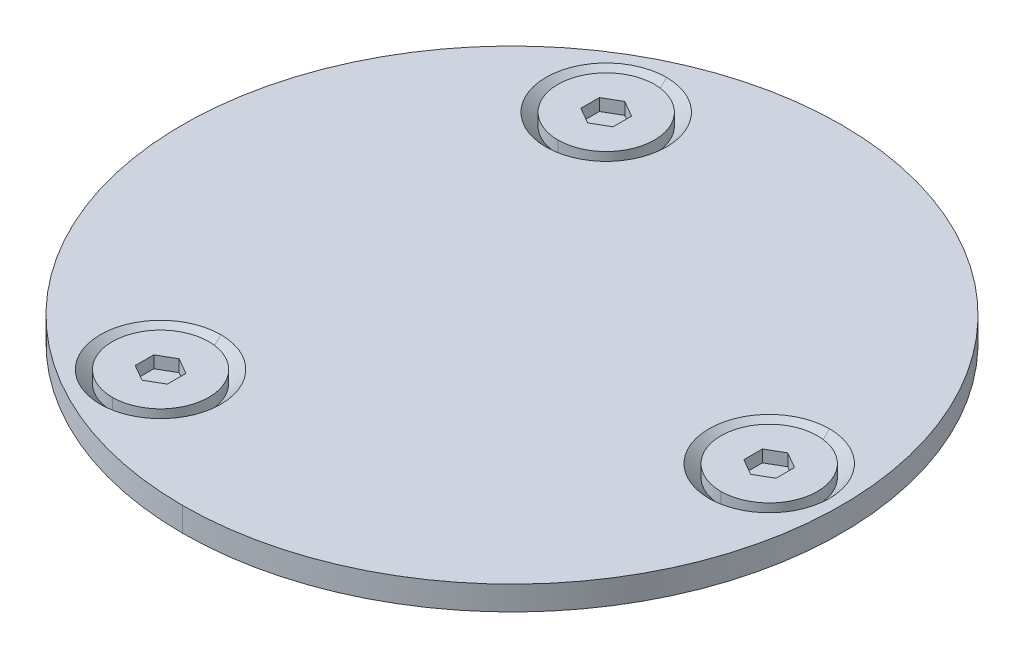
ISO-10303-21;
HEADER;
FILE_DESCRIPTION(('STEP AP214'),'2;1');
FILE_NAME('part.step','',(''),(''),'','','');
FILE_SCHEMA(('AUTOMOTIVE_DESIGN { 1 0 10303 214 1 1 1 1 }'));
ENDSEC;
DATA;
#1=APPLICATION_CONTEXT('core data for automotive mechanical design processes');
#2=APPLICATION_PROTOCOL_DEFINITION('international standard','automotive_design',2000,#1);
#3=PRODUCT_CONTEXT('',#1,'mechanical');
#4=PRODUCT('Part','Part','',(#3));
#5=PRODUCT_RELATED_PRODUCT_CATEGORY('part','',(#4));
#6=PRODUCT_DEFINITION_FORMATION('','',#4);
#7=PRODUCT_DEFINITION_CONTEXT('part definition',#1,'design');
#8=PRODUCT_DEFINITION('design','',#6,#7);
#9=PRODUCT_DEFINITION_SHAPE('','',#8);
#10=(LENGTH_UNIT() NAMED_UNIT(*) SI_UNIT(.MILLI.,.METRE.));
#11=(NAMED_UNIT(*) PLANE_ANGLE_UNIT() SI_UNIT($,.RADIAN.));
#12=(NAMED_UNIT(*) SI_UNIT($,.STERADIAN.) SOLID_ANGLE_UNIT());
#13=UNCERTAINTY_MEASURE_WITH_UNIT(LENGTH_MEASURE(1.E-05),#10,'distance_accuracy_value','');
#14=(GEOMETRIC_REPRESENTATION_CONTEXT(3) GLOBAL_UNCERTAINTY_ASSIGNED_CONTEXT((#13)) GLOBAL_UNIT_ASSIGNED_CONTEXT((#10,
#11,#12)) REPRESENTATION_CONTEXT('',''));
#15=CARTESIAN_POINT('',(0.,0.,0.));
#16=DIRECTION('',(0.,0.,1.));
#17=DIRECTION('',(1.,0.,0.));
#18=AXIS2_PLACEMENT_3D('',#15,#16,#17);
#19=CARTESIAN_POINT('',(0.,1.5,0.));
#20=DIRECTION('',(0.,-1.,0.));
#21=DIRECTION('',(1.,0.,0.));
#22=AXIS2_PLACEMENT_3D('',#19,#20,#21);
#23=CYLINDRICAL_SURFACE('',#22,20.5);
#24=DIRECTION('',(0.,-1.,0.));
#25=VECTOR('',#24,1.);
#26=CARTESIAN_POINT('',(0.,1.5,20.5));
#27=LINE('',#26,#25);
#28=CARTESIAN_POINT('',(0.,1.5,20.5));
#29=VERTEX_POINT('',#28);
#30=CARTESIAN_POINT('',(0.,0.,20.5));
#31=VERTEX_POINT('',#30);
#32=EDGE_CURVE('E11',#29,#31,#27,.T.);
#33=ORIENTED_EDGE('',*,*,#32,.F.);
#34=CARTESIAN_POINT('',(0.,1.5,0.));
#35=DIRECTION('',(0.,1.,0.));
#36=DIRECTION('',(1.,0.,0.));
#37=AXIS2_PLACEMENT_3D('',#34,#35,#36);
#38=CIRCLE('',#37,20.5);
#39=CARTESIAN_POINT('',(0.,1.5,-20.5));
#40=VERTEX_POINT('',#39);
#41=EDGE_CURVE('E25',#40,#29,#38,.T.);
#42=ORIENTED_EDGE('',*,*,#41,.F.);
#43=DIRECTION('',(0.,-1.,0.));
#44=VECTOR('',#43,1.);
#45=CARTESIAN_POINT('',(0.,1.5,-20.5));
#46=LINE('',#45,#44);
#47=CARTESIAN_POINT('',(0.,0.,-20.5));
#48=VERTEX_POINT('',#47);
#49=EDGE_CURVE('E631',#40,#48,#46,.T.);
#50=ORIENTED_EDGE('',*,*,#49,.T.);
#51=CARTESIAN_POINT('',(0.,0.,0.));
#52=DIRECTION('',(0.,1.,0.));
#53=DIRECTION('',(1.,0.,0.));
#54=AXIS2_PLACEMENT_3D('',#51,#52,#53);
#55=CIRCLE('',#54,20.5);
#56=EDGE_CURVE('E627',#48,#31,#55,.T.);
#57=ORIENTED_EDGE('',*,*,#56,.T.);
#58=EDGE_LOOP('',(#33,#42,#50,#57));
#59=FACE_BOUND('',#58,.T.);
#60=ADVANCED_FACE('F17',(#59),#23,.T.);
#61=CARTESIAN_POINT('',(0.,0.,0.));
#62=DIRECTION('',(0.,1.,0.));
#63=DIRECTION('',(0.,0.,1.));
#64=AXIS2_PLACEMENT_3D('',#61,#62,#63);
#65=PLANE('',#64);
#66=CARTESIAN_POINT('',(0.,0.,0.));
#67=DIRECTION('',(0.,1.,0.));
#68=DIRECTION('',(0.,0.,1.));
#69=AXIS2_PLACEMENT_3D('',#66,#67,#68);
#70=CIRCLE('',#69,20.5);
#71=EDGE_CURVE('E622',#31,#48,#70,.T.);
#72=ORIENTED_EDGE('',*,*,#71,.F.);
#73=ORIENTED_EDGE('',*,*,#56,.F.);
#74=EDGE_LOOP('',(#72,#73));
#75=FACE_BOUND('',#74,.T.);
#76=ADVANCED_FACE('F646',(#75),#65,.F.);
#77=CARTESIAN_POINT('',(0.,1.5,0.));
#78=DIRECTION('',(0.,-1.,0.));
#79=DIRECTION('',(-1.,0.,0.));
#80=AXIS2_PLACEMENT_3D('',#77,#78,#79);
#81=CYLINDRICAL_SURFACE('',#80,20.5);
#82=ORIENTED_EDGE('',*,*,#32,.T.);
#83=ORIENTED_EDGE('',*,*,#71,.T.);
#84=ORIENTED_EDGE('',*,*,#49,.F.);
#85=CARTESIAN_POINT('',(0.,1.5,0.));
#86=DIRECTION('',(0.,1.,0.));
#87=DIRECTION('',(0.,0.,1.));
#88=AXIS2_PLACEMENT_3D('',#85,#86,#87);
#89=CIRCLE('',#88,20.5);
#90=EDGE_CURVE('E617',#29,#40,#89,.T.);
#91=ORIENTED_EDGE('',*,*,#90,.F.);
#92=EDGE_LOOP('',(#82,#83,#84,#91));
#93=FACE_BOUND('',#92,.T.);
#94=ADVANCED_FACE('F642',(#93),#81,.T.);
#95=CARTESIAN_POINT('',(0.,1.5,0.));
#96=DIRECTION('',(0.,1.,0.));
#97=DIRECTION('',(0.,0.,1.));
#98=AXIS2_PLACEMENT_3D('',#95,#96,#97);
#99=PLANE('',#98);
#100=CARTESIAN_POINT('',(-8.,1.5,13.86));
#101=DIRECTION('',(0.,-1.,0.));
#102=DIRECTION('',(0.,0.,-1.));
#103=AXIS2_PLACEMENT_3D('',#100,#101,#102);
#104=CIRCLE('',#103,3.75);
#105=CARTESIAN_POINT('',(-8.,1.5,10.11));
#106=VERTEX_POINT('',#105);
#107=CARTESIAN_POINT('',(-8.,1.5,17.61));
#108=VERTEX_POINT('',#107);
#109=EDGE_CURVE('E613',#106,#108,#104,.T.);
#110=ORIENTED_EDGE('',*,*,#109,.T.);
#111=CARTESIAN_POINT('',(-8.,1.5,13.86));
#112=DIRECTION('',(0.,-1.,0.));
#113=DIRECTION('',(0.,0.,-1.));
#114=AXIS2_PLACEMENT_3D('',#111,#112,#113);
#115=CIRCLE('',#114,3.75);
#116=EDGE_CURVE('E609',#108,#106,#115,.T.);
#117=ORIENTED_EDGE('',*,*,#116,.T.);
#118=EDGE_LOOP('',(#110,#117));
#119=FACE_BOUND('',#118,.T.);
#120=CARTESIAN_POINT('',(-8.,1.5,-13.86));
#121=DIRECTION('',(0.,-1.,0.));
#122=DIRECTION('',(0.,0.,-1.));
#123=AXIS2_PLACEMENT_3D('',#120,#121,#122);
#124=CIRCLE('',#123,3.75);
#125=CARTESIAN_POINT('',(-8.,1.5,-17.61));
#126=VERTEX_POINT('',#125);
#127=CARTESIAN_POINT('',(-8.,1.5,-10.11));
#128=VERTEX_POINT('',#127);
#129=EDGE_CURVE('E605',#126,#128,#124,.T.);
#130=ORIENTED_EDGE('',*,*,#129,.T.);
#131=CARTESIAN_POINT('',(-8.,1.5,-13.86));
#132=DIRECTION('',(0.,-1.,0.));
#133=DIRECTION('',(0.,0.,-1.));
#134=AXIS2_PLACEMENT_3D('',#131,#132,#133);
#135=CIRCLE('',#134,3.75);
#136=EDGE_CURVE('E601',#128,#126,#135,.T.);
#137=ORIENTED_EDGE('',*,*,#136,.T.);
#138=EDGE_LOOP('',(#130,#137));
#139=FACE_BOUND('',#138,.T.);
#140=CARTESIAN_POINT('',(16.,1.5,0.));
#141=DIRECTION('',(0.,-1.,0.));
#142=DIRECTION('',(0.,0.,-1.));
#143=AXIS2_PLACEMENT_3D('',#140,#141,#142);
#144=CIRCLE('',#143,3.75);
#145=CARTESIAN_POINT('',(16.,1.5,-3.75));
#146=VERTEX_POINT('',#145);
#147=CARTESIAN_POINT('',(16.,1.5,3.75));
#148=VERTEX_POINT('',#147);
#149=EDGE_CURVE('E597',#146,#148,#144,.T.);
#150=ORIENTED_EDGE('',*,*,#149,.T.);
#151=CARTESIAN_POINT('',(16.,1.5,0.));
#152=DIRECTION('',(0.,-1.,0.));
#153=DIRECTION('',(0.,0.,-1.));
#154=AXIS2_PLACEMENT_3D('',#151,#152,#153);
#155=CIRCLE('',#154,3.75);
#156=EDGE_CURVE('E593',#148,#146,#155,.T.);
#157=ORIENTED_EDGE('',*,*,#156,.T.);
#158=EDGE_LOOP('',(#150,#157));
#159=FACE_BOUND('',#158,.T.);
#160=ORIENTED_EDGE('',*,*,#90,.T.);
#161=ORIENTED_EDGE('',*,*,#41,.T.);
#162=EDGE_LOOP('',(#160,#161));
#163=FACE_BOUND('',#162,.T.);
#164=ADVANCED_FACE('F640',(#119,#139,#159,#163),#99,.T.);
#165=CARTESIAN_POINT('',(16.,0.75000000000003,0.));
#166=DIRECTION('',(0.,1.,0.));
#167=DIRECTION('',(1.,0.,0.));
#168=AXIS2_PLACEMENT_3D('',#165,#166,#167);
#169=CONICAL_SURFACE('',#168,3.,0.785398163397469);
#170=DIRECTION('',(0.,0.707106781186533,-0.707106781186562));
#171=VECTOR('',#170,1.);
#172=CARTESIAN_POINT('',(16.,0.75000000000003,-3.));
#173=LINE('',#172,#171);
#174=CARTESIAN_POINT('',(16.,0.75000000000003,-3.));
#175=VERTEX_POINT('',#174);
#176=EDGE_CURVE('E588',#175,#146,#173,.T.);
#177=ORIENTED_EDGE('',*,*,#176,.T.);
#178=ORIENTED_EDGE('',*,*,#156,.F.);
#179=DIRECTION('',(0.,0.707106781186533,0.707106781186562));
#180=VECTOR('',#179,1.);
#181=CARTESIAN_POINT('',(16.,0.75000000000003,3.));
#182=LINE('',#181,#180);
#183=CARTESIAN_POINT('',(16.,0.75000000000003,3.));
#184=VERTEX_POINT('',#183);
#185=EDGE_CURVE('E583',#184,#148,#182,.T.);
#186=ORIENTED_EDGE('',*,*,#185,.F.);
#187=CARTESIAN_POINT('',(16.,0.75000000000003,0.));
#188=DIRECTION('',(0.,-1.,0.));
#189=DIRECTION('',(0.,0.,-1.));
#190=AXIS2_PLACEMENT_3D('',#187,#188,#189);
#191=CIRCLE('',#190,3.);
#192=EDGE_CURVE('E579',#184,#175,#191,.T.);
#193=ORIENTED_EDGE('',*,*,#192,.T.);
#194=EDGE_LOOP('',(#177,#178,#186,#193));
#195=FACE_BOUND('',#194,.T.);
#196=ADVANCED_FACE('F657',(#195),#169,.F.);
#197=CARTESIAN_POINT('',(16.,0.,0.));
#198=DIRECTION('',(0.,-1.,0.));
#199=DIRECTION('',(1.,0.,-1.61702901641324E-09));
#200=AXIS2_PLACEMENT_3D('',#197,#198,#199);
#201=CYLINDRICAL_SURFACE('',#200,3.);
#202=DIRECTION('',(0.,-1.,0.));
#203=VECTOR('',#202,1.);
#204=CARTESIAN_POINT('',(16.,1.5,3.));
#205=LINE('',#204,#203);
#206=CARTESIAN_POINT('',(16.,1.5,3.));
#207=VERTEX_POINT('',#206);
#208=EDGE_CURVE('E574',#207,#184,#205,.T.);
#209=ORIENTED_EDGE('',*,*,#208,.F.);
#210=CARTESIAN_POINT('',(16.,1.5,0.));
#211=DIRECTION('',(0.,-1.,0.));
#212=DIRECTION('',(0.,0.,-1.));
#213=AXIS2_PLACEMENT_3D('',#210,#211,#212);
#214=CIRCLE('',#213,3.);
#215=CARTESIAN_POINT('',(16.,1.5,-3.));
#216=VERTEX_POINT('',#215);
#217=EDGE_CURVE('E570',#207,#216,#214,.T.);
#218=ORIENTED_EDGE('',*,*,#217,.T.);
#219=DIRECTION('',(0.,-1.,0.));
#220=VECTOR('',#219,1.);
#221=CARTESIAN_POINT('',(16.,1.5,-3.));
#222=LINE('',#221,#220);
#223=EDGE_CURVE('E565',#216,#175,#222,.T.);
#224=ORIENTED_EDGE('',*,*,#223,.T.);
#225=ORIENTED_EDGE('',*,*,#192,.F.);
#226=EDGE_LOOP('',(#209,#218,#224,#225));
#227=FACE_BOUND('',#226,.T.);
#228=ADVANCED_FACE('F661',(#227),#201,.T.);
#229=CARTESIAN_POINT('',(16.,0.,0.));
#230=DIRECTION('',(0.,-1.,0.));
#231=DIRECTION('',(-1.,0.,0.));
#232=AXIS2_PLACEMENT_3D('',#229,#230,#231);
#233=CYLINDRICAL_SURFACE('',#232,3.);
#234=ORIENTED_EDGE('',*,*,#208,.T.);
#235=CARTESIAN_POINT('',(16.,0.75000000000003,0.));
#236=DIRECTION('',(0.,-1.,0.));
#237=DIRECTION('',(0.,0.,-1.));
#238=AXIS2_PLACEMENT_3D('',#235,#236,#237);
#239=CIRCLE('',#238,3.);
#240=EDGE_CURVE('E560',#175,#184,#239,.T.);
#241=ORIENTED_EDGE('',*,*,#240,.F.);
#242=ORIENTED_EDGE('',*,*,#223,.F.);
#243=CARTESIAN_POINT('',(16.,1.5,0.));
#244=DIRECTION('',(0.,-1.,0.));
#245=DIRECTION('',(0.,0.,-1.));
#246=AXIS2_PLACEMENT_3D('',#243,#244,#245);
#247=CIRCLE('',#246,3.);
#248=EDGE_CURVE('E555',#216,#207,#247,.T.);
#249=ORIENTED_EDGE('',*,*,#248,.T.);
#250=EDGE_LOOP('',(#234,#241,#242,#249));
#251=FACE_BOUND('',#250,.T.);
#252=ADVANCED_FACE('F665',(#251),#233,.T.);
#253=CARTESIAN_POINT('',(0.,1.5,0.));
#254=DIRECTION('',(0.,1.,0.));
#255=DIRECTION('',(0.,0.,1.));
#256=AXIS2_PLACEMENT_3D('',#253,#254,#255);
#257=PLANE('',#256);
#258=DIRECTION('',(0.,0.,1.));
#259=VECTOR('',#258,1.);
#260=CARTESIAN_POINT('',(15.,1.5,-0.57735026918963));
#261=LINE('',#260,#259);
#262=CARTESIAN_POINT('',(15.,1.5,-0.57735026918963));
#263=VERTEX_POINT('',#262);
#264=CARTESIAN_POINT('',(15.,1.5,0.57735026918963));
#265=VERTEX_POINT('',#264);
#266=EDGE_CURVE('E550',#263,#265,#261,.T.);
#267=ORIENTED_EDGE('',*,*,#266,.F.);
#268=DIRECTION('',(-0.866025403784422,0.,0.500000000000029));
#269=VECTOR('',#268,1.);
#270=CARTESIAN_POINT('',(16.,1.5,-1.1547005383793));
#271=LINE('',#270,#269);
#272=CARTESIAN_POINT('',(16.,1.5,-1.1547005383793));
#273=VERTEX_POINT('',#272);
#274=EDGE_CURVE('E545',#273,#263,#271,.T.);
#275=ORIENTED_EDGE('',*,*,#274,.F.);
#276=DIRECTION('',(-0.866025403784422,0.,-0.500000000000029));
#277=VECTOR('',#276,1.);
#278=CARTESIAN_POINT('',(17.,1.5,-0.57735026918963));
#279=LINE('',#278,#277);
#280=CARTESIAN_POINT('',(17.,1.5,-0.57735026918963));
#281=VERTEX_POINT('',#280);
#282=EDGE_CURVE('E540',#281,#273,#279,.T.);
#283=ORIENTED_EDGE('',*,*,#282,.F.);
#284=DIRECTION('',(0.,0.,-1.));
#285=VECTOR('',#284,1.);
#286=CARTESIAN_POINT('',(17.,1.5,0.57735026918963));
#287=LINE('',#286,#285);
#288=CARTESIAN_POINT('',(17.,1.5,0.57735026918963));
#289=VERTEX_POINT('',#288);
#290=EDGE_CURVE('E535',#289,#281,#287,.T.);
#291=ORIENTED_EDGE('',*,*,#290,.F.);
#292=DIRECTION('',(0.866025403784422,0.,-0.500000000000029));
#293=VECTOR('',#292,1.);
#294=CARTESIAN_POINT('',(16.,1.5,1.1547005383793));
#295=LINE('',#294,#293);
#296=CARTESIAN_POINT('',(16.,1.5,1.1547005383793));
#297=VERTEX_POINT('',#296);
#298=EDGE_CURVE('E530',#297,#289,#295,.T.);
#299=ORIENTED_EDGE('',*,*,#298,.F.);
#300=DIRECTION('',(0.866025403784422,0.,0.500000000000029));
#301=VECTOR('',#300,1.);
#302=CARTESIAN_POINT('',(15.,1.5,0.57735026918963));
#303=LINE('',#302,#301);
#304=EDGE_CURVE('E525',#265,#297,#303,.T.);
#305=ORIENTED_EDGE('',*,*,#304,.F.);
#306=EDGE_LOOP('',(#267,#275,#283,#291,#299,#305));
#307=FACE_BOUND('',#306,.T.);
#308=ORIENTED_EDGE('',*,*,#217,.F.);
#309=ORIENTED_EDGE('',*,*,#248,.F.);
#310=EDGE_LOOP('',(#308,#309));
#311=FACE_BOUND('',#310,.T.);
#312=ADVANCED_FACE('F669',(#307,#311),#257,.T.);
#313=CARTESIAN_POINT('',(15.,0.75,0.57735026918963));
#314=DIRECTION('',(-0.500000000000029,0.,0.866025403784422));
#315=DIRECTION('',(0.866025403784422,0.,0.500000000000029));
#316=AXIS2_PLACEMENT_3D('',#313,#314,#315);
#317=PLANE('',#316);
#318=ORIENTED_EDGE('',*,*,#304,.T.);
#319=DIRECTION('',(0.,1.,0.));
#320=VECTOR('',#319,1.);
#321=CARTESIAN_POINT('',(16.,0.75,1.1547005383793));
#322=LINE('',#321,#320);
#323=CARTESIAN_POINT('',(16.,0.75,1.1547005383793));
#324=VERTEX_POINT('',#323);
#325=EDGE_CURVE('E520',#324,#297,#322,.T.);
#326=ORIENTED_EDGE('',*,*,#325,.F.);
#327=DIRECTION('',(0.866025403784422,0.,0.500000000000029));
#328=VECTOR('',#327,1.);
#329=CARTESIAN_POINT('',(15.,0.75,0.57735026918963));
#330=LINE('',#329,#328);
#331=CARTESIAN_POINT('',(15.,0.75,0.57735026918963));
#332=VERTEX_POINT('',#331);
#333=EDGE_CURVE('E515',#332,#324,#330,.T.);
#334=ORIENTED_EDGE('',*,*,#333,.F.);
#335=DIRECTION('',(0.,1.,0.));
#336=VECTOR('',#335,1.);
#337=CARTESIAN_POINT('',(15.,0.75,0.57735026918963));
#338=LINE('',#337,#336);
#339=EDGE_CURVE('E510',#332,#265,#338,.T.);
#340=ORIENTED_EDGE('',*,*,#339,.T.);
#341=EDGE_LOOP('',(#318,#326,#334,#340));
#342=FACE_BOUND('',#341,.T.);
#343=ADVANCED_FACE('F673',(#342),#317,.F.);
#344=CARTESIAN_POINT('',(15.,0.75,-0.57735026918963));
#345=DIRECTION('',(-1.,0.,0.));
#346=DIRECTION('',(0.,0.,1.));
#347=AXIS2_PLACEMENT_3D('',#344,#345,#346);
#348=PLANE('',#347);
#349=ORIENTED_EDGE('',*,*,#266,.T.);
#350=ORIENTED_EDGE('',*,*,#339,.F.);
#351=DIRECTION('',(0.,0.,1.));
#352=VECTOR('',#351,1.);
#353=CARTESIAN_POINT('',(15.,0.75,-0.57735026918963));
#354=LINE('',#353,#352);
#355=CARTESIAN_POINT('',(15.,0.75,-0.57735026918963));
#356=VERTEX_POINT('',#355);
#357=EDGE_CURVE('E505',#356,#332,#354,.T.);
#358=ORIENTED_EDGE('',*,*,#357,.F.);
#359=DIRECTION('',(0.,1.,0.));
#360=VECTOR('',#359,1.);
#361=CARTESIAN_POINT('',(15.,0.75,-0.57735026918963));
#362=LINE('',#361,#360);
#363=EDGE_CURVE('E500',#356,#263,#362,.T.);
#364=ORIENTED_EDGE('',*,*,#363,.T.);
#365=EDGE_LOOP('',(#349,#350,#358,#364));
#366=FACE_BOUND('',#365,.T.);
#367=ADVANCED_FACE('F677',(#366),#348,.F.);
#368=CARTESIAN_POINT('',(16.,0.75,-1.1547005383793));
#369=DIRECTION('',(-0.500000000000029,0.,-0.866025403784422));
#370=DIRECTION('',(-0.866025403784422,0.,0.500000000000029));
#371=AXIS2_PLACEMENT_3D('',#368,#369,#370);
#372=PLANE('',#371);
#373=ORIENTED_EDGE('',*,*,#274,.T.);
#374=ORIENTED_EDGE('',*,*,#363,.F.);
#375=DIRECTION('',(-0.866025403784422,0.,0.500000000000029));
#376=VECTOR('',#375,1.);
#377=CARTESIAN_POINT('',(16.,0.75,-1.1547005383793));
#378=LINE('',#377,#376);
#379=CARTESIAN_POINT('',(16.,0.75,-1.1547005383793));
#380=VERTEX_POINT('',#379);
#381=EDGE_CURVE('E495',#380,#356,#378,.T.);
#382=ORIENTED_EDGE('',*,*,#381,.F.);
#383=DIRECTION('',(0.,1.,0.));
#384=VECTOR('',#383,1.);
#385=CARTESIAN_POINT('',(16.,0.75,-1.1547005383793));
#386=LINE('',#385,#384);
#387=EDGE_CURVE('E490',#380,#273,#386,.T.);
#388=ORIENTED_EDGE('',*,*,#387,.T.);
#389=EDGE_LOOP('',(#373,#374,#382,#388));
#390=FACE_BOUND('',#389,.T.);
#391=ADVANCED_FACE('F681',(#390),#372,.F.);
#392=CARTESIAN_POINT('',(17.,0.75,-0.57735026918963));
#393=DIRECTION('',(0.500000000000029,0.,-0.866025403784422));
#394=DIRECTION('',(-0.866025403784422,0.,-0.500000000000029));
#395=AXIS2_PLACEMENT_3D('',#392,#393,#394);
#396=PLANE('',#395);
#397=ORIENTED_EDGE('',*,*,#282,.T.);
#398=ORIENTED_EDGE('',*,*,#387,.F.);
#399=DIRECTION('',(-0.866025403784422,0.,-0.500000000000029));
#400=VECTOR('',#399,1.);
#401=CARTESIAN_POINT('',(17.,0.75,-0.57735026918963));
#402=LINE('',#401,#400);
#403=CARTESIAN_POINT('',(17.,0.75,-0.57735026918963));
#404=VERTEX_POINT('',#403);
#405=EDGE_CURVE('E485',#404,#380,#402,.T.);
#406=ORIENTED_EDGE('',*,*,#405,.F.);
#407=DIRECTION('',(0.,1.,0.));
#408=VECTOR('',#407,1.);
#409=CARTESIAN_POINT('',(17.,0.75,-0.57735026918963));
#410=LINE('',#409,#408);
#411=EDGE_CURVE('E480',#404,#281,#410,.T.);
#412=ORIENTED_EDGE('',*,*,#411,.T.);
#413=EDGE_LOOP('',(#397,#398,#406,#412));
#414=FACE_BOUND('',#413,.T.);
#415=ADVANCED_FACE('F685',(#414),#396,.F.);
#416=CARTESIAN_POINT('',(17.,0.75,0.57735026918963));
#417=DIRECTION('',(1.,0.,0.));
#418=DIRECTION('',(0.,0.,-1.));
#419=AXIS2_PLACEMENT_3D('',#416,#417,#418);
#420=PLANE('',#419);
#421=ORIENTED_EDGE('',*,*,#290,.T.);
#422=ORIENTED_EDGE('',*,*,#411,.F.);
#423=DIRECTION('',(0.,0.,-1.));
#424=VECTOR('',#423,1.);
#425=CARTESIAN_POINT('',(17.,0.75,0.57735026918963));
#426=LINE('',#425,#424);
#427=CARTESIAN_POINT('',(17.,0.75,0.57735026918963));
#428=VERTEX_POINT('',#427);
#429=EDGE_CURVE('E475',#428,#404,#426,.T.);
#430=ORIENTED_EDGE('',*,*,#429,.F.);
#431=DIRECTION('',(0.,1.,0.));
#432=VECTOR('',#431,1.);
#433=CARTESIAN_POINT('',(17.,0.75,0.57735026918963));
#434=LINE('',#433,#432);
#435=EDGE_CURVE('E470',#428,#289,#434,.T.);
#436=ORIENTED_EDGE('',*,*,#435,.T.);
#437=EDGE_LOOP('',(#421,#422,#430,#436));
#438=FACE_BOUND('',#437,.T.);
#439=ADVANCED_FACE('F689',(#438),#420,.F.);
#440=CARTESIAN_POINT('',(16.,0.75,1.1547005383793));
#441=DIRECTION('',(0.500000000000029,0.,0.866025403784422));
#442=DIRECTION('',(0.866025403784422,0.,-0.500000000000029));
#443=AXIS2_PLACEMENT_3D('',#440,#441,#442);
#444=PLANE('',#443);
#445=ORIENTED_EDGE('',*,*,#298,.T.);
#446=ORIENTED_EDGE('',*,*,#435,.F.);
#447=DIRECTION('',(0.866025403784422,0.,-0.500000000000029));
#448=VECTOR('',#447,1.);
#449=CARTESIAN_POINT('',(16.,0.75,1.1547005383793));
#450=LINE('',#449,#448);
#451=EDGE_CURVE('E465',#324,#428,#450,.T.);
#452=ORIENTED_EDGE('',*,*,#451,.F.);
#453=ORIENTED_EDGE('',*,*,#325,.T.);
#454=EDGE_LOOP('',(#445,#446,#452,#453));
#455=FACE_BOUND('',#454,.T.);
#456=ADVANCED_FACE('F693',(#455),#444,.F.);
#457=CARTESIAN_POINT('',(0.,0.75,0.));
#458=DIRECTION('',(0.,1.,0.));
#459=DIRECTION('',(0.,0.,1.));
#460=AXIS2_PLACEMENT_3D('',#457,#458,#459);
#461=PLANE('',#460);
#462=ORIENTED_EDGE('',*,*,#357,.T.);
#463=ORIENTED_EDGE('',*,*,#333,.T.);
#464=ORIENTED_EDGE('',*,*,#451,.T.);
#465=ORIENTED_EDGE('',*,*,#429,.T.);
#466=ORIENTED_EDGE('',*,*,#405,.T.);
#467=ORIENTED_EDGE('',*,*,#381,.T.);
#468=EDGE_LOOP('',(#462,#463,#464,#465,#466,#467));
#469=FACE_BOUND('',#468,.T.);
#470=ADVANCED_FACE('F697',(#469),#461,.T.);
#471=CARTESIAN_POINT('',(16.,0.75000000000003,0.));
#472=DIRECTION('',(0.,1.,0.));
#473=DIRECTION('',(-1.,0.,0.));
#474=AXIS2_PLACEMENT_3D('',#471,#472,#473);
#475=CONICAL_SURFACE('',#474,3.,0.785398163397469);
#476=ORIENTED_EDGE('',*,*,#176,.F.);
#477=ORIENTED_EDGE('',*,*,#240,.T.);
#478=ORIENTED_EDGE('',*,*,#185,.T.);
#479=ORIENTED_EDGE('',*,*,#149,.F.);
#480=EDGE_LOOP('',(#476,#477,#478,#479));
#481=FACE_BOUND('',#480,.T.);
#482=ADVANCED_FACE('F701',(#481),#475,.F.);
#483=CARTESIAN_POINT('',(-8.,0.75000000000001,-13.86));
#484=DIRECTION('',(0.,1.,0.));
#485=DIRECTION('',(1.,0.,0.));
#486=AXIS2_PLACEMENT_3D('',#483,#484,#485);
#487=CONICAL_SURFACE('',#486,3.,0.785398163397455);
#488=DIRECTION('',(0.,0.707106781186543,-0.707106781186553));
#489=VECTOR('',#488,1.);
#490=CARTESIAN_POINT('',(-8.,0.75000000000001,-16.86));
#491=LINE('',#490,#489);
#492=CARTESIAN_POINT('',(-8.,0.75000000000001,-16.86));
#493=VERTEX_POINT('',#492);
#494=EDGE_CURVE('E460',#493,#126,#491,.T.);
#495=ORIENTED_EDGE('',*,*,#494,.T.);
#496=ORIENTED_EDGE('',*,*,#136,.F.);
#497=DIRECTION('',(0.,0.707106781186543,0.707106781186552));
#498=VECTOR('',#497,1.);
#499=CARTESIAN_POINT('',(-8.,0.75000000000001,-10.86));
#500=LINE('',#499,#498);
#501=CARTESIAN_POINT('',(-8.,0.75000000000001,-10.86));
#502=VERTEX_POINT('',#501);
#503=EDGE_CURVE('E455',#502,#128,#500,.T.);
#504=ORIENTED_EDGE('',*,*,#503,.F.);
#505=CARTESIAN_POINT('',(-8.,0.75000000000001,-13.86));
#506=DIRECTION('',(0.,-1.,0.));
#507=DIRECTION('',(0.,0.,-1.));
#508=AXIS2_PLACEMENT_3D('',#505,#506,#507);
#509=CIRCLE('',#508,3.);
#510=EDGE_CURVE('E451',#502,#493,#509,.T.);
#511=ORIENTED_EDGE('',*,*,#510,.T.);
#512=EDGE_LOOP('',(#495,#496,#504,#511));
#513=FACE_BOUND('',#512,.T.);
#514=ADVANCED_FACE('F705',(#513),#487,.F.);
#515=CARTESIAN_POINT('',(-8.,0.,-13.86));
#516=DIRECTION('',(0.,-1.,0.));
#517=DIRECTION('',(1.,0.,-1.61702901641324E-09));
#518=AXIS2_PLACEMENT_3D('',#515,#516,#517);
#519=CYLINDRICAL_SURFACE('',#518,3.);
#520=DIRECTION('',(0.,-1.,0.));
#521=VECTOR('',#520,1.);
#522=CARTESIAN_POINT('',(-8.,1.5,-10.86));
#523=LINE('',#522,#521);
#524=CARTESIAN_POINT('',(-8.,1.5,-10.86));
#525=VERTEX_POINT('',#524);
#526=EDGE_CURVE('E446',#525,#502,#523,.T.);
#527=ORIENTED_EDGE('',*,*,#526,.F.);
#528=CARTESIAN_POINT('',(-8.,1.5,-13.86));
#529=DIRECTION('',(0.,-1.,0.));
#530=DIRECTION('',(0.,0.,-1.));
#531=AXIS2_PLACEMENT_3D('',#528,#529,#530);
#532=CIRCLE('',#531,3.);
#533=CARTESIAN_POINT('',(-8.,1.5,-16.86));
#534=VERTEX_POINT('',#533);
#535=EDGE_CURVE('E442',#525,#534,#532,.T.);
#536=ORIENTED_EDGE('',*,*,#535,.T.);
#537=DIRECTION('',(0.,-1.,0.));
#538=VECTOR('',#537,1.);
#539=CARTESIAN_POINT('',(-8.,1.5,-16.86));
#540=LINE('',#539,#538);
#541=EDGE_CURVE('E437',#534,#493,#540,.T.);
#542=ORIENTED_EDGE('',*,*,#541,.T.);
#543=ORIENTED_EDGE('',*,*,#510,.F.);
#544=EDGE_LOOP('',(#527,#536,#542,#543));
#545=FACE_BOUND('',#544,.T.);
#546=ADVANCED_FACE('F709',(#545),#519,.T.);
#547=CARTESIAN_POINT('',(-8.,0.,-13.86));
#548=DIRECTION('',(0.,-1.,0.));
#549=DIRECTION('',(-1.,0.,0.));
#550=AXIS2_PLACEMENT_3D('',#547,#548,#549);
#551=CYLINDRICAL_SURFACE('',#550,3.);
#552=ORIENTED_EDGE('',*,*,#526,.T.);
#553=CARTESIAN_POINT('',(-8.,0.75000000000001,-13.86));
#554=DIRECTION('',(0.,-1.,0.));
#555=DIRECTION('',(0.,0.,-1.));
#556=AXIS2_PLACEMENT_3D('',#553,#554,#555);
#557=CIRCLE('',#556,3.);
#558=EDGE_CURVE('E432',#493,#502,#557,.T.);
#559=ORIENTED_EDGE('',*,*,#558,.F.);
#560=ORIENTED_EDGE('',*,*,#541,.F.);
#561=CARTESIAN_POINT('',(-8.,1.5,-13.86));
#562=DIRECTION('',(0.,-1.,0.));
#563=DIRECTION('',(0.,0.,-1.));
#564=AXIS2_PLACEMENT_3D('',#561,#562,#563);
#565=CIRCLE('',#564,3.);
#566=EDGE_CURVE('E427',#534,#525,#565,.T.);
#567=ORIENTED_EDGE('',*,*,#566,.T.);
#568=EDGE_LOOP('',(#552,#559,#560,#567));
#569=FACE_BOUND('',#568,.T.);
#570=ADVANCED_FACE('F713',(#569),#551,.T.);
#571=CARTESIAN_POINT('',(0.,1.5,0.));
#572=DIRECTION('',(0.,1.,0.));
#573=DIRECTION('',(0.,0.,1.));
#574=AXIS2_PLACEMENT_3D('',#571,#572,#573);
#575=PLANE('',#574);
#576=DIRECTION('',(0.,0.,1.));
#577=VECTOR('',#576,1.);
#578=CARTESIAN_POINT('',(-9.,1.5,-14.4373502691896));
#579=LINE('',#578,#577);
#580=CARTESIAN_POINT('',(-9.,1.5,-14.4373502691896));
#581=VERTEX_POINT('',#580);
#582=CARTESIAN_POINT('',(-9.,1.5,-13.2826497308104));
#583=VERTEX_POINT('',#582);
#584=EDGE_CURVE('E422',#581,#583,#579,.T.);
#585=ORIENTED_EDGE('',*,*,#584,.F.);
#586=DIRECTION('',(-0.866025403784422,0.,0.500000000000029));
#587=VECTOR('',#586,1.);
#588=CARTESIAN_POINT('',(-8.,1.5,-15.0147005383793));
#589=LINE('',#588,#587);
#590=CARTESIAN_POINT('',(-8.,1.5,-15.0147005383793));
#591=VERTEX_POINT('',#590);
#592=EDGE_CURVE('E417',#591,#581,#589,.T.);
#593=ORIENTED_EDGE('',*,*,#592,.F.);
#594=DIRECTION('',(-0.866025403784422,0.,-0.500000000000029));
#595=VECTOR('',#594,1.);
#596=CARTESIAN_POINT('',(-7.,1.5,-14.4373502691896));
#597=LINE('',#596,#595);
#598=CARTESIAN_POINT('',(-7.,1.5,-14.4373502691896));
#599=VERTEX_POINT('',#598);
#600=EDGE_CURVE('E412',#599,#591,#597,.T.);
#601=ORIENTED_EDGE('',*,*,#600,.F.);
#602=DIRECTION('',(0.,0.,-1.));
#603=VECTOR('',#602,1.);
#604=CARTESIAN_POINT('',(-7.,1.5,-13.2826497308104));
#605=LINE('',#604,#603);
#606=CARTESIAN_POINT('',(-7.,1.5,-13.2826497308104));
#607=VERTEX_POINT('',#606);
#608=EDGE_CURVE('E407',#607,#599,#605,.T.);
#609=ORIENTED_EDGE('',*,*,#608,.F.);
#610=DIRECTION('',(0.866025403784422,0.,-0.500000000000029));
#611=VECTOR('',#610,1.);
#612=CARTESIAN_POINT('',(-8.,1.5,-12.7052994616207));
#613=LINE('',#612,#611);
#614=CARTESIAN_POINT('',(-8.,1.5,-12.7052994616207));
#615=VERTEX_POINT('',#614);
#616=EDGE_CURVE('E402',#615,#607,#613,.T.);
#617=ORIENTED_EDGE('',*,*,#616,.F.);
#618=DIRECTION('',(0.866025403784422,0.,0.500000000000029));
#619=VECTOR('',#618,1.);
#620=CARTESIAN_POINT('',(-9.,1.5,-13.2826497308104));
#621=LINE('',#620,#619);
#622=EDGE_CURVE('E397',#583,#615,#621,.T.);
#623=ORIENTED_EDGE('',*,*,#622,.F.);
#624=EDGE_LOOP('',(#585,#593,#601,#609,#617,#623));
#625=FACE_BOUND('',#624,.T.);
#626=ORIENTED_EDGE('',*,*,#535,.F.);
#627=ORIENTED_EDGE('',*,*,#566,.F.);
#628=EDGE_LOOP('',(#626,#627));
#629=FACE_BOUND('',#628,.T.);
#630=ADVANCED_FACE('F717',(#625,#629),#575,.T.);
#631=CARTESIAN_POINT('',(-9.,0.75,-13.2826497308104));
#632=DIRECTION('',(-0.500000000000029,0.,0.866025403784422));
#633=DIRECTION('',(0.866025403784422,0.,0.500000000000029));
#634=AXIS2_PLACEMENT_3D('',#631,#632,#633);
#635=PLANE('',#634);
#636=ORIENTED_EDGE('',*,*,#622,.T.);
#637=DIRECTION('',(0.,1.,0.));
#638=VECTOR('',#637,1.);
#639=CARTESIAN_POINT('',(-8.,0.75,-12.7052994616207));
#640=LINE('',#639,#638);
#641=CARTESIAN_POINT('',(-8.,0.75,-12.7052994616207));
#642=VERTEX_POINT('',#641);
#643=EDGE_CURVE('E392',#642,#615,#640,.T.);
#644=ORIENTED_EDGE('',*,*,#643,.F.);
#645=DIRECTION('',(0.866025403784422,0.,0.500000000000029));
#646=VECTOR('',#645,1.);
#647=CARTESIAN_POINT('',(-9.,0.75,-13.2826497308104));
#648=LINE('',#647,#646);
#649=CARTESIAN_POINT('',(-9.,0.75,-13.2826497308104));
#650=VERTEX_POINT('',#649);
#651=EDGE_CURVE('E387',#650,#642,#648,.T.);
#652=ORIENTED_EDGE('',*,*,#651,.F.);
#653=DIRECTION('',(0.,1.,0.));
#654=VECTOR('',#653,1.);
#655=CARTESIAN_POINT('',(-9.,0.75,-13.2826497308104));
#656=LINE('',#655,#654);
#657=EDGE_CURVE('E382',#650,#583,#656,.T.);
#658=ORIENTED_EDGE('',*,*,#657,.T.);
#659=EDGE_LOOP('',(#636,#644,#652,#658));
#660=FACE_BOUND('',#659,.T.);
#661=ADVANCED_FACE('F721',(#660),#635,.F.);
#662=CARTESIAN_POINT('',(-9.,0.75,-14.4373502691896));
#663=DIRECTION('',(-1.,0.,0.));
#664=DIRECTION('',(0.,0.,1.));
#665=AXIS2_PLACEMENT_3D('',#662,#663,#664);
#666=PLANE('',#665);
#667=ORIENTED_EDGE('',*,*,#584,.T.);
#668=ORIENTED_EDGE('',*,*,#657,.F.);
#669=DIRECTION('',(0.,0.,1.));
#670=VECTOR('',#669,1.);
#671=CARTESIAN_POINT('',(-9.,0.75,-14.4373502691896));
#672=LINE('',#671,#670);
#673=CARTESIAN_POINT('',(-9.,0.75,-14.4373502691896));
#674=VERTEX_POINT('',#673);
#675=EDGE_CURVE('E377',#674,#650,#672,.T.);
#676=ORIENTED_EDGE('',*,*,#675,.F.);
#677=DIRECTION('',(0.,1.,0.));
#678=VECTOR('',#677,1.);
#679=CARTESIAN_POINT('',(-9.,0.75,-14.4373502691896));
#680=LINE('',#679,#678);
#681=EDGE_CURVE('E372',#674,#581,#680,.T.);
#682=ORIENTED_EDGE('',*,*,#681,.T.);
#683=EDGE_LOOP('',(#667,#668,#676,#682));
#684=FACE_BOUND('',#683,.T.);
#685=ADVANCED_FACE('F725',(#684),#666,.F.);
#686=CARTESIAN_POINT('',(-8.,0.75,-15.0147005383793));
#687=DIRECTION('',(-0.500000000000029,0.,-0.866025403784422));
#688=DIRECTION('',(-0.866025403784422,0.,0.500000000000029));
#689=AXIS2_PLACEMENT_3D('',#686,#687,#688);
#690=PLANE('',#689);
#691=ORIENTED_EDGE('',*,*,#592,.T.);
#692=ORIENTED_EDGE('',*,*,#681,.F.);
#693=DIRECTION('',(-0.866025403784422,0.,0.500000000000029));
#694=VECTOR('',#693,1.);
#695=CARTESIAN_POINT('',(-8.,0.75,-15.0147005383793));
#696=LINE('',#695,#694);
#697=CARTESIAN_POINT('',(-8.,0.75,-15.0147005383793));
#698=VERTEX_POINT('',#697);
#699=EDGE_CURVE('E367',#698,#674,#696,.T.);
#700=ORIENTED_EDGE('',*,*,#699,.F.);
#701=DIRECTION('',(0.,1.,0.));
#702=VECTOR('',#701,1.);
#703=CARTESIAN_POINT('',(-8.,0.75,-15.0147005383793));
#704=LINE('',#703,#702);
#705=EDGE_CURVE('E362',#698,#591,#704,.T.);
#706=ORIENTED_EDGE('',*,*,#705,.T.);
#707=EDGE_LOOP('',(#691,#692,#700,#706));
#708=FACE_BOUND('',#707,.T.);
#709=ADVANCED_FACE('F729',(#708),#690,.F.);
#710=CARTESIAN_POINT('',(-7.,0.75,-14.4373502691896));
#711=DIRECTION('',(0.500000000000029,0.,-0.866025403784422));
#712=DIRECTION('',(-0.866025403784422,0.,-0.500000000000029));
#713=AXIS2_PLACEMENT_3D('',#710,#711,#712);
#714=PLANE('',#713);
#715=ORIENTED_EDGE('',*,*,#600,.T.);
#716=ORIENTED_EDGE('',*,*,#705,.F.);
#717=DIRECTION('',(-0.866025403784422,0.,-0.500000000000029));
#718=VECTOR('',#717,1.);
#719=CARTESIAN_POINT('',(-7.,0.75,-14.4373502691896));
#720=LINE('',#719,#718);
#721=CARTESIAN_POINT('',(-7.,0.75,-14.4373502691896));
#722=VERTEX_POINT('',#721);
#723=EDGE_CURVE('E357',#722,#698,#720,.T.);
#724=ORIENTED_EDGE('',*,*,#723,.F.);
#725=DIRECTION('',(0.,1.,0.));
#726=VECTOR('',#725,1.);
#727=CARTESIAN_POINT('',(-7.,0.75,-14.4373502691896));
#728=LINE('',#727,#726);
#729=EDGE_CURVE('E352',#722,#599,#728,.T.);
#730=ORIENTED_EDGE('',*,*,#729,.T.);
#731=EDGE_LOOP('',(#715,#716,#724,#730));
#732=FACE_BOUND('',#731,.T.);
#733=ADVANCED_FACE('F733',(#732),#714,.F.);
#734=CARTESIAN_POINT('',(-7.,0.75,-13.2826497308104));
#735=DIRECTION('',(1.,0.,0.));
#736=DIRECTION('',(0.,0.,-1.));
#737=AXIS2_PLACEMENT_3D('',#734,#735,#736);
#738=PLANE('',#737);
#739=ORIENTED_EDGE('',*,*,#608,.T.);
#740=ORIENTED_EDGE('',*,*,#729,.F.);
#741=DIRECTION('',(0.,0.,-1.));
#742=VECTOR('',#741,1.);
#743=CARTESIAN_POINT('',(-7.,0.75,-13.2826497308104));
#744=LINE('',#743,#742);
#745=CARTESIAN_POINT('',(-7.,0.75,-13.2826497308104));
#746=VERTEX_POINT('',#745);
#747=EDGE_CURVE('E347',#746,#722,#744,.T.);
#748=ORIENTED_EDGE('',*,*,#747,.F.);
#749=DIRECTION('',(0.,1.,0.));
#750=VECTOR('',#749,1.);
#751=CARTESIAN_POINT('',(-7.,0.75,-13.2826497308104));
#752=LINE('',#751,#750);
#753=EDGE_CURVE('E342',#746,#607,#752,.T.);
#754=ORIENTED_EDGE('',*,*,#753,.T.);
#755=EDGE_LOOP('',(#739,#740,#748,#754));
#756=FACE_BOUND('',#755,.T.);
#757=ADVANCED_FACE('F737',(#756),#738,.F.);
#758=CARTESIAN_POINT('',(-8.,0.75,-12.7052994616207));
#759=DIRECTION('',(0.500000000000029,0.,0.866025403784422));
#760=DIRECTION('',(0.866025403784422,0.,-0.500000000000029));
#761=AXIS2_PLACEMENT_3D('',#758,#759,#760);
#762=PLANE('',#761);
#763=ORIENTED_EDGE('',*,*,#616,.T.);
#764=ORIENTED_EDGE('',*,*,#753,.F.);
#765=DIRECTION('',(0.866025403784422,0.,-0.500000000000029));
#766=VECTOR('',#765,1.);
#767=CARTESIAN_POINT('',(-8.,0.75,-12.7052994616207));
#768=LINE('',#767,#766);
#769=EDGE_CURVE('E337',#642,#746,#768,.T.);
#770=ORIENTED_EDGE('',*,*,#769,.F.);
#771=ORIENTED_EDGE('',*,*,#643,.T.);
#772=EDGE_LOOP('',(#763,#764,#770,#771));
#773=FACE_BOUND('',#772,.T.);
#774=ADVANCED_FACE('F741',(#773),#762,.F.);
#775=CARTESIAN_POINT('',(-24.,0.75,-13.86));
#776=DIRECTION('',(0.,1.,0.));
#777=DIRECTION('',(0.,0.,1.));
#778=AXIS2_PLACEMENT_3D('',#775,#776,#777);
#779=PLANE('',#778);
#780=ORIENTED_EDGE('',*,*,#675,.T.);
#781=ORIENTED_EDGE('',*,*,#651,.T.);
#782=ORIENTED_EDGE('',*,*,#769,.T.);
#783=ORIENTED_EDGE('',*,*,#747,.T.);
#784=ORIENTED_EDGE('',*,*,#723,.T.);
#785=ORIENTED_EDGE('',*,*,#699,.T.);
#786=EDGE_LOOP('',(#780,#781,#782,#783,#784,#785));
#787=FACE_BOUND('',#786,.T.);
#788=ADVANCED_FACE('F745',(#787),#779,.T.);
#789=CARTESIAN_POINT('',(-8.,0.75000000000001,-13.86));
#790=DIRECTION('',(0.,1.,0.));
#791=DIRECTION('',(-1.,0.,0.));
#792=AXIS2_PLACEMENT_3D('',#789,#790,#791);
#793=CONICAL_SURFACE('',#792,3.,0.785398163397455);
#794=ORIENTED_EDGE('',*,*,#494,.F.);
#795=ORIENTED_EDGE('',*,*,#558,.T.);
#796=ORIENTED_EDGE('',*,*,#503,.T.);
#797=ORIENTED_EDGE('',*,*,#129,.F.);
#798=EDGE_LOOP('',(#794,#795,#796,#797));
#799=FACE_BOUND('',#798,.T.);
#800=ADVANCED_FACE('F749',(#799),#793,.F.);
#801=CARTESIAN_POINT('',(-8.,0.74999999999999,13.86));
#802=DIRECTION('',(0.,1.,0.));
#803=DIRECTION('',(1.,0.,0.));
#804=AXIS2_PLACEMENT_3D('',#801,#802,#803);
#805=CONICAL_SURFACE('',#804,3.,0.785398163397442);
#806=DIRECTION('',(0.,0.707106781186552,-0.707106781186543));
#807=VECTOR('',#806,1.);
#808=CARTESIAN_POINT('',(-8.,0.74999999999999,10.86));
#809=LINE('',#808,#807);
#810=CARTESIAN_POINT('',(-8.,0.74999999999999,10.86));
#811=VERTEX_POINT('',#810);
#812=EDGE_CURVE('E332',#811,#106,#809,.T.);
#813=ORIENTED_EDGE('',*,*,#812,.T.);
#814=ORIENTED_EDGE('',*,*,#116,.F.);
#815=DIRECTION('',(0.,0.707106781186552,0.707106781186543));
#816=VECTOR('',#815,1.);
#817=CARTESIAN_POINT('',(-8.,0.74999999999999,16.86));
#818=LINE('',#817,#816);
#819=CARTESIAN_POINT('',(-8.,0.74999999999999,16.86));
#820=VERTEX_POINT('',#819);
#821=EDGE_CURVE('E327',#820,#108,#818,.T.);
#822=ORIENTED_EDGE('',*,*,#821,.F.);
#823=CARTESIAN_POINT('',(-8.,0.74999999999999,13.86));
#824=DIRECTION('',(0.,-1.,0.));
#825=DIRECTION('',(0.,0.,-1.));
#826=AXIS2_PLACEMENT_3D('',#823,#824,#825);
#827=CIRCLE('',#826,3.);
#828=EDGE_CURVE('E323',#820,#811,#827,.T.);
#829=ORIENTED_EDGE('',*,*,#828,.T.);
#830=EDGE_LOOP('',(#813,#814,#822,#829));
#831=FACE_BOUND('',#830,.T.);
#832=ADVANCED_FACE('F753',(#831),#805,.F.);
#833=CARTESIAN_POINT('',(-8.,0.,13.86));
#834=DIRECTION('',(0.,-1.,0.));
#835=DIRECTION('',(1.,0.,-1.61702901641324E-09));
#836=AXIS2_PLACEMENT_3D('',#833,#834,#835);
#837=CYLINDRICAL_SURFACE('',#836,3.);
#838=DIRECTION('',(0.,-1.,0.));
#839=VECTOR('',#838,1.);
#840=CARTESIAN_POINT('',(-8.,1.5,16.86));
#841=LINE('',#840,#839);
#842=CARTESIAN_POINT('',(-8.,1.5,16.86));
#843=VERTEX_POINT('',#842);
#844=EDGE_CURVE('E318',#843,#820,#841,.T.);
#845=ORIENTED_EDGE('',*,*,#844,.F.);
#846=CARTESIAN_POINT('',(-8.,1.5,13.86));
#847=DIRECTION('',(0.,-1.,0.));
#848=DIRECTION('',(0.,0.,-1.));
#849=AXIS2_PLACEMENT_3D('',#846,#847,#848);
#850=CIRCLE('',#849,3.);
#851=CARTESIAN_POINT('',(-8.,1.5,10.86));
#852=VERTEX_POINT('',#851);
#853=EDGE_CURVE('E314',#843,#852,#850,.T.);
#854=ORIENTED_EDGE('',*,*,#853,.T.);
#855=DIRECTION('',(0.,-1.,0.));
#856=VECTOR('',#855,1.);
#857=CARTESIAN_POINT('',(-8.,1.5,10.86));
#858=LINE('',#857,#856);
#859=EDGE_CURVE('E309',#852,#811,#858,.T.);
#860=ORIENTED_EDGE('',*,*,#859,.T.);
#861=ORIENTED_EDGE('',*,*,#828,.F.);
#862=EDGE_LOOP('',(#845,#854,#860,#861));
#863=FACE_BOUND('',#862,.T.);
#864=ADVANCED_FACE('F757',(#863),#837,.T.);
#865=CARTESIAN_POINT('',(-8.,0.,13.86));
#866=DIRECTION('',(0.,-1.,0.));
#867=DIRECTION('',(-1.,0.,0.));
#868=AXIS2_PLACEMENT_3D('',#865,#866,#867);
#869=CYLINDRICAL_SURFACE('',#868,3.);
#870=ORIENTED_EDGE('',*,*,#844,.T.);
#871=CARTESIAN_POINT('',(-8.,0.74999999999999,13.86));
#872=DIRECTION('',(0.,-1.,0.));
#873=DIRECTION('',(0.,0.,-1.));
#874=AXIS2_PLACEMENT_3D('',#871,#872,#873);
#875=CIRCLE('',#874,3.);
#876=EDGE_CURVE('E304',#811,#820,#875,.T.);
#877=ORIENTED_EDGE('',*,*,#876,.F.);
#878=ORIENTED_EDGE('',*,*,#859,.F.);
#879=CARTESIAN_POINT('',(-8.,1.5,13.86));
#880=DIRECTION('',(0.,-1.,0.));
#881=DIRECTION('',(0.,0.,-1.));
#882=AXIS2_PLACEMENT_3D('',#879,#880,#881);
#883=CIRCLE('',#882,3.);
#884=EDGE_CURVE('E299',#852,#843,#883,.T.);
#885=ORIENTED_EDGE('',*,*,#884,.T.);
#886=EDGE_LOOP('',(#870,#877,#878,#885));
#887=FACE_BOUND('',#886,.T.);
#888=ADVANCED_FACE('F761',(#887),#869,.T.);
#889=CARTESIAN_POINT('',(0.,1.5,0.));
#890=DIRECTION('',(0.,1.,0.));
#891=DIRECTION('',(0.,0.,1.));
#892=AXIS2_PLACEMENT_3D('',#889,#890,#891);
#893=PLANE('',#892);
#894=DIRECTION('',(0.,0.,1.));
#895=VECTOR('',#894,1.);
#896=CARTESIAN_POINT('',(-9.,1.5,13.2826497308104));
#897=LINE('',#896,#895);
#898=CARTESIAN_POINT('',(-9.,1.5,13.2826497308104));
#899=VERTEX_POINT('',#898);
#900=CARTESIAN_POINT('',(-9.,1.5,14.4373502691896));
#901=VERTEX_POINT('',#900);
#902=EDGE_CURVE('E294',#899,#901,#897,.T.);
#903=ORIENTED_EDGE('',*,*,#902,.F.);
#904=DIRECTION('',(-0.866025403784422,0.,0.500000000000029));
#905=VECTOR('',#904,1.);
#906=CARTESIAN_POINT('',(-8.,1.5,12.7052994616207));
#907=LINE('',#906,#905);
#908=CARTESIAN_POINT('',(-8.,1.5,12.7052994616207));
#909=VERTEX_POINT('',#908);
#910=EDGE_CURVE('E289',#909,#899,#907,.T.);
#911=ORIENTED_EDGE('',*,*,#910,.F.);
#912=DIRECTION('',(-0.866025403784422,0.,-0.500000000000029));
#913=VECTOR('',#912,1.);
#914=CARTESIAN_POINT('',(-7.,1.5,13.2826497308104));
#915=LINE('',#914,#913);
#916=CARTESIAN_POINT('',(-7.,1.5,13.2826497308104));
#917=VERTEX_POINT('',#916);
#918=EDGE_CURVE('E284',#917,#909,#915,.T.);
#919=ORIENTED_EDGE('',*,*,#918,.F.);
#920=DIRECTION('',(0.,0.,-1.));
#921=VECTOR('',#920,1.);
#922=CARTESIAN_POINT('',(-7.,1.5,14.4373502691896));
#923=LINE('',#922,#921);
#924=CARTESIAN_POINT('',(-7.,1.5,14.4373502691896));
#925=VERTEX_POINT('',#924);
#926=EDGE_CURVE('E280',#925,#917,#923,.T.);
#927=ORIENTED_EDGE('',*,*,#926,.F.);
#928=DIRECTION('',(0.866025403784422,0.,-0.500000000000029));
#929=VECTOR('',#928,1.);
#930=CARTESIAN_POINT('',(-8.,1.5,15.0147005383793));
#931=LINE('',#930,#929);
#932=CARTESIAN_POINT('',(-8.,1.5,15.0147005383793));
#933=VERTEX_POINT('',#932);
#934=EDGE_CURVE('E227',#933,#925,#931,.T.);
#935=ORIENTED_EDGE('',*,*,#934,.F.);
#936=DIRECTION('',(0.866025403784422,0.,0.500000000000029));
#937=VECTOR('',#936,1.);
#938=CARTESIAN_POINT('',(-9.,1.5,14.4373502691896));
#939=LINE('',#938,#937);
#940=EDGE_CURVE('E272',#901,#933,#939,.T.);
#941=ORIENTED_EDGE('',*,*,#940,.F.);
#942=EDGE_LOOP('',(#903,#911,#919,#927,#935,#941));
#943=FACE_BOUND('',#942,.T.);
#944=ORIENTED_EDGE('',*,*,#853,.F.);
#945=ORIENTED_EDGE('',*,*,#884,.F.);
#946=EDGE_LOOP('',(#944,#945));
#947=FACE_BOUND('',#946,.T.);
#948=ADVANCED_FACE('F765',(#943,#947),#893,.T.);
#949=CARTESIAN_POINT('',(-9.,0.75,14.4373502691896));
#950=DIRECTION('',(-0.500000000000029,0.,0.866025403784422));
#951=DIRECTION('',(0.866025403784422,0.,0.500000000000029));
#952=AXIS2_PLACEMENT_3D('',#949,#950,#951);
#953=PLANE('',#952);
#954=ORIENTED_EDGE('',*,*,#940,.T.);
#955=DIRECTION('',(0.,1.,0.));
#956=VECTOR('',#955,1.);
#957=CARTESIAN_POINT('',(-8.,0.75,15.0147005383793));
#958=LINE('',#957,#956);
#959=CARTESIAN_POINT('',(-8.,0.75,15.0147005383793));
#960=VERTEX_POINT('',#959);
#961=EDGE_CURVE('E268',#960,#933,#958,.T.);
#962=ORIENTED_EDGE('',*,*,#961,.F.);
#963=DIRECTION('',(0.866025403784422,0.,0.500000000000029));
#964=VECTOR('',#963,1.);
#965=CARTESIAN_POINT('',(-9.,0.75,14.4373502691896));
#966=LINE('',#965,#964);
#967=CARTESIAN_POINT('',(-9.,0.75,14.4373502691896));
#968=VERTEX_POINT('',#967);
#969=EDGE_CURVE('E222',#968,#960,#966,.T.);
#970=ORIENTED_EDGE('',*,*,#969,.F.);
#971=DIRECTION('',(0.,1.,0.));
#972=VECTOR('',#971,1.);
#973=CARTESIAN_POINT('',(-9.,0.75,14.4373502691896));
#974=LINE('',#973,#972);
#975=EDGE_CURVE('E260',#968,#901,#974,.T.);
#976=ORIENTED_EDGE('',*,*,#975,.T.);
#977=EDGE_LOOP('',(#954,#962,#970,#976));
#978=FACE_BOUND('',#977,.T.);
#979=ADVANCED_FACE('F769',(#978),#953,.F.);
#980=CARTESIAN_POINT('',(-9.,0.75,13.2826497308104));
#981=DIRECTION('',(-1.,0.,0.));
#982=DIRECTION('',(0.,0.,1.));
#983=AXIS2_PLACEMENT_3D('',#980,#981,#982);
#984=PLANE('',#983);
#985=ORIENTED_EDGE('',*,*,#902,.T.);
#986=ORIENTED_EDGE('',*,*,#975,.F.);
#987=DIRECTION('',(0.,0.,1.));
#988=VECTOR('',#987,1.);
#989=CARTESIAN_POINT('',(-9.,0.75,13.2826497308104));
#990=LINE('',#989,#988);
#991=CARTESIAN_POINT('',(-9.,0.75,13.2826497308104));
#992=VERTEX_POINT('',#991);
#993=EDGE_CURVE('E256',#992,#968,#990,.T.);
#994=ORIENTED_EDGE('',*,*,#993,.F.);
#995=DIRECTION('',(0.,1.,0.));
#996=VECTOR('',#995,1.);
#997=CARTESIAN_POINT('',(-9.,0.75,13.2826497308104));
#998=LINE('',#997,#996);
#999=EDGE_CURVE('E251',#992,#899,#998,.T.);
#1000=ORIENTED_EDGE('',*,*,#999,.T.);
#1001=EDGE_LOOP('',(#985,#986,#994,#1000));
#1002=FACE_BOUND('',#1001,.T.);
#1003=ADVANCED_FACE('F773',(#1002),#984,.F.);
#1004=CARTESIAN_POINT('',(-8.,0.75,12.7052994616207));
#1005=DIRECTION('',(-0.500000000000029,0.,-0.866025403784422));
#1006=DIRECTION('',(-0.866025403784422,0.,0.500000000000029));
#1007=AXIS2_PLACEMENT_3D('',#1004,#1005,#1006);
#1008=PLANE('',#1007);
#1009=ORIENTED_EDGE('',*,*,#910,.T.);
#1010=ORIENTED_EDGE('',*,*,#999,.F.);
#1011=DIRECTION('',(-0.866025403784422,0.,0.500000000000029));
#1012=VECTOR('',#1011,1.);
#1013=CARTESIAN_POINT('',(-8.,0.75,12.7052994616207));
#1014=LINE('',#1013,#1012);
#1015=CARTESIAN_POINT('',(-8.,0.75,12.7052994616207));
#1016=VERTEX_POINT('',#1015);
#1017=EDGE_CURVE('E246',#1016,#992,#1014,.T.);
#1018=ORIENTED_EDGE('',*,*,#1017,.F.);
#1019=DIRECTION('',(0.,1.,0.));
#1020=VECTOR('',#1019,1.);
#1021=CARTESIAN_POINT('',(-8.,0.75,12.7052994616207));
#1022=LINE('',#1021,#1020);
#1023=EDGE_CURVE('E241',#1016,#909,#1022,.T.);
#1024=ORIENTED_EDGE('',*,*,#1023,.T.);
#1025=EDGE_LOOP('',(#1009,#1010,#1018,#1024));
#1026=FACE_BOUND('',#1025,.T.);
#1027=ADVANCED_FACE('F777',(#1026),#1008,.F.);
#1028=CARTESIAN_POINT('',(-7.,0.75,13.2826497308104));
#1029=DIRECTION('',(0.500000000000029,0.,-0.866025403784422));
#1030=DIRECTION('',(-0.866025403784422,0.,-0.500000000000029));
#1031=AXIS2_PLACEMENT_3D('',#1028,#1029,#1030);
#1032=PLANE('',#1031);
#1033=ORIENTED_EDGE('',*,*,#918,.T.);
#1034=ORIENTED_EDGE('',*,*,#1023,.F.);
#1035=DIRECTION('',(-0.866025403784422,0.,-0.500000000000029));
#1036=VECTOR('',#1035,1.);
#1037=CARTESIAN_POINT('',(-7.,0.75,13.2826497308104));
#1038=LINE('',#1037,#1036);
#1039=CARTESIAN_POINT('',(-7.,0.75,13.2826497308104));
#1040=VERTEX_POINT('',#1039);
#1041=EDGE_CURVE('E237',#1040,#1016,#1038,.T.);
#1042=ORIENTED_EDGE('',*,*,#1041,.F.);
#1043=DIRECTION('',(0.,1.,0.));
#1044=VECTOR('',#1043,1.);
#1045=CARTESIAN_POINT('',(-7.,0.75,13.2826497308104));
#1046=LINE('',#1045,#1044);
#1047=EDGE_CURVE('E213',#1040,#917,#1046,.T.);
#1048=ORIENTED_EDGE('',*,*,#1047,.T.);
#1049=EDGE_LOOP('',(#1033,#1034,#1042,#1048));
#1050=FACE_BOUND('',#1049,.T.);
#1051=ADVANCED_FACE('F781',(#1050),#1032,.F.);
#1052=CARTESIAN_POINT('',(-7.,0.75,14.4373502691896));
#1053=DIRECTION('',(1.,0.,0.));
#1054=DIRECTION('',(0.,0.,-1.));
#1055=AXIS2_PLACEMENT_3D('',#1052,#1053,#1054);
#1056=PLANE('',#1055);
#1057=ORIENTED_EDGE('',*,*,#926,.T.);
#1058=ORIENTED_EDGE('',*,*,#1047,.F.);
#1059=DIRECTION('',(0.,0.,-1.));
#1060=VECTOR('',#1059,1.);
#1061=CARTESIAN_POINT('',(-7.,0.75,14.4373502691896));
#1062=LINE('',#1061,#1060);
#1063=CARTESIAN_POINT('',(-7.,0.75,14.4373502691896));
#1064=VERTEX_POINT('',#1063);
#1065=EDGE_CURVE('E205',#1064,#1040,#1062,.T.);
#1066=ORIENTED_EDGE('',*,*,#1065,.F.);
#1067=DIRECTION('',(0.,1.,0.));
#1068=VECTOR('',#1067,1.);
#1069=CARTESIAN_POINT('',(-7.,0.75,14.4373502691896));
#1070=LINE('',#1069,#1068);
#1071=EDGE_CURVE('E210',#1064,#925,#1070,.T.);
#1072=ORIENTED_EDGE('',*,*,#1071,.T.);
#1073=EDGE_LOOP('',(#1057,#1058,#1066,#1072));
#1074=FACE_BOUND('',#1073,.T.);
#1075=ADVANCED_FACE('F208',(#1074),#1056,.F.);
#1076=CARTESIAN_POINT('',(-8.,0.75,15.0147005383793));
#1077=DIRECTION('',(0.500000000000029,0.,0.866025403784422));
#1078=DIRECTION('',(0.866025403784422,0.,-0.500000000000029));
#1079=AXIS2_PLACEMENT_3D('',#1076,#1077,#1078);
#1080=PLANE('',#1079);
#1081=ORIENTED_EDGE('',*,*,#934,.T.);
#1082=ORIENTED_EDGE('',*,*,#1071,.F.);
#1083=DIRECTION('',(0.866025403784422,0.,-0.500000000000029));
#1084=VECTOR('',#1083,1.);
#1085=CARTESIAN_POINT('',(-8.,0.75,15.0147005383793));
#1086=LINE('',#1085,#1084);
#1087=EDGE_CURVE('E219',#960,#1064,#1086,.T.);
#1088=ORIENTED_EDGE('',*,*,#1087,.F.);
#1089=ORIENTED_EDGE('',*,*,#961,.T.);
#1090=EDGE_LOOP('',(#1081,#1082,#1088,#1089));
#1091=FACE_BOUND('',#1090,.T.);
#1092=ADVANCED_FACE('F226',(#1091),#1080,.F.);
#1093=CARTESIAN_POINT('',(-24.,0.75,13.86));
#1094=DIRECTION('',(0.,1.,0.));
#1095=DIRECTION('',(0.,0.,1.));
#1096=AXIS2_PLACEMENT_3D('',#1093,#1094,#1095);
#1097=PLANE('',#1096);
#1098=ORIENTED_EDGE('',*,*,#993,.T.);
#1099=ORIENTED_EDGE('',*,*,#969,.T.);
#1100=ORIENTED_EDGE('',*,*,#1087,.T.);
#1101=ORIENTED_EDGE('',*,*,#1065,.T.);
#1102=ORIENTED_EDGE('',*,*,#1041,.T.);
#1103=ORIENTED_EDGE('',*,*,#1017,.T.);
#1104=EDGE_LOOP('',(#1098,#1099,#1100,#1101,#1102,#1103));
#1105=FACE_BOUND('',#1104,.T.);
#1106=ADVANCED_FACE('F221',(#1105),#1097,.T.);
#1107=CARTESIAN_POINT('',(-8.,0.74999999999999,13.86));
#1108=DIRECTION('',(0.,1.,0.));
#1109=DIRECTION('',(-1.,0.,0.));
#1110=AXIS2_PLACEMENT_3D('',#1107,#1108,#1109);
#1111=CONICAL_SURFACE('',#1110,3.,0.785398163397442);
#1112=ORIENTED_EDGE('',*,*,#812,.F.);
#1113=ORIENTED_EDGE('',*,*,#876,.T.);
#1114=ORIENTED_EDGE('',*,*,#821,.T.);
#1115=ORIENTED_EDGE('',*,*,#109,.F.);
#1116=EDGE_LOOP('',(#1112,#1113,#1114,#1115));
#1117=FACE_BOUND('',#1116,.T.);
#1118=ADVANCED_FACE('F792',(#1117),#1111,.F.);
#1119=CLOSED_SHELL('',(#60,#76,#94,#164,#196,#228,#252,#312,#343,#367,#391,#415,#439,#456,#470,
#482,#514,#546,#570,#630,#661,#685,#709,#733,#757,#774,#788,#800,#832,#864,#888,#948,#979,#1003,
#1027,#1051,#1075,#1092,#1106,#1118));
#1120=MANIFOLD_SOLID_BREP('B1',#1119);
#1121=ADVANCED_BREP_SHAPE_REPRESENTATION('',(#18,#1120),#14);
#1122=SHAPE_DEFINITION_REPRESENTATION(#9,#1121);
ENDSEC;
END-ISO-10303-21;
